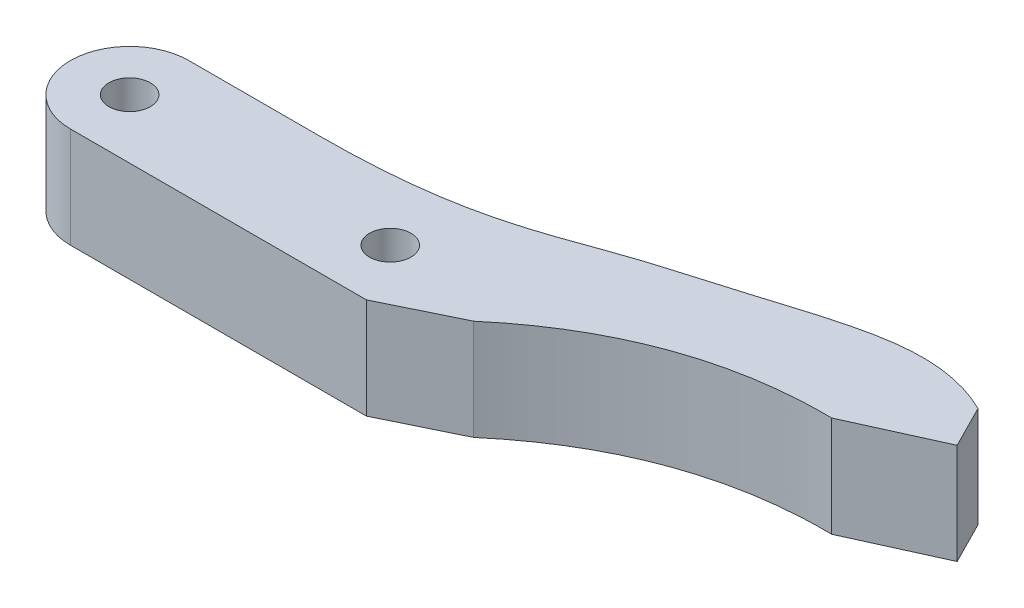
ISO-10303-21;
HEADER;
FILE_DESCRIPTION(('STEP AP214'),'2;1');
FILE_NAME('part.step','',(''),(''),'','','');
FILE_SCHEMA(('AUTOMOTIVE_DESIGN { 1 0 10303 214 1 1 1 1 }'));
ENDSEC;
DATA;
#1=APPLICATION_CONTEXT('core data for automotive mechanical design processes');
#2=APPLICATION_PROTOCOL_DEFINITION('international standard','automotive_design',2000,#1);
#3=PRODUCT_CONTEXT('',#1,'mechanical');
#4=PRODUCT('Part','Part','',(#3));
#5=PRODUCT_RELATED_PRODUCT_CATEGORY('part','',(#4));
#6=PRODUCT_DEFINITION_FORMATION('','',#4);
#7=PRODUCT_DEFINITION_CONTEXT('part definition',#1,'design');
#8=PRODUCT_DEFINITION('design','',#6,#7);
#9=PRODUCT_DEFINITION_SHAPE('','',#8);
#10=(LENGTH_UNIT() NAMED_UNIT(*) SI_UNIT(.MILLI.,.METRE.));
#11=(NAMED_UNIT(*) PLANE_ANGLE_UNIT() SI_UNIT($,.RADIAN.));
#12=(NAMED_UNIT(*) SI_UNIT($,.STERADIAN.) SOLID_ANGLE_UNIT());
#13=UNCERTAINTY_MEASURE_WITH_UNIT(LENGTH_MEASURE(1.E-05),#10,'distance_accuracy_value','');
#14=(GEOMETRIC_REPRESENTATION_CONTEXT(3) GLOBAL_UNCERTAINTY_ASSIGNED_CONTEXT((#13)) GLOBAL_UNIT_ASSIGNED_CONTEXT((#10,
#11,#12)) REPRESENTATION_CONTEXT('',''));
#15=CARTESIAN_POINT('',(0.,0.,0.));
#16=DIRECTION('',(0.,0.,1.));
#17=DIRECTION('',(1.,0.,0.));
#18=AXIS2_PLACEMENT_3D('',#15,#16,#17);
#19=CARTESIAN_POINT('',(0.,8.5,-5.));
#20=DIRECTION('',(0.,0.,1.));
#21=DIRECTION('',(1.,0.,0.));
#22=AXIS2_PLACEMENT_3D('',#19,#20,#21);
#23=PLANE('',#22);
#24=DIRECTION('',(0.,1.,0.));
#25=VECTOR('',#24,1.);
#26=CARTESIAN_POINT('',(11.,0.,-5.));
#27=LINE('',#26,#25);
#28=CARTESIAN_POINT('',(11.,0.,-5.));
#29=VERTEX_POINT('',#28);
#30=CARTESIAN_POINT('',(11.,8.5,-5.));
#31=VERTEX_POINT('',#30);
#32=EDGE_CURVE('E102',#29,#31,#27,.T.);
#33=ORIENTED_EDGE('',*,*,#32,.F.);
#34=DIRECTION('',(-1.,0.,0.));
#35=VECTOR('',#34,1.);
#36=CARTESIAN_POINT('',(0.,0.,-5.));
#37=LINE('',#36,#35);
#38=CARTESIAN_POINT('',(0.,0.,-5.));
#39=VERTEX_POINT('',#38);
#40=EDGE_CURVE('E91',#29,#39,#37,.T.);
#41=ORIENTED_EDGE('',*,*,#40,.T.);
#42=DIRECTION('',(0.,-1.,0.));
#43=VECTOR('',#42,1.);
#44=CARTESIAN_POINT('',(0.,8.5,-5.));
#45=LINE('',#44,#43);
#46=CARTESIAN_POINT('',(0.,8.5,-5.));
#47=VERTEX_POINT('',#46);
#48=EDGE_CURVE('E11',#47,#39,#45,.T.);
#49=ORIENTED_EDGE('',*,*,#48,.F.);
#50=DIRECTION('',(-1.,0.,0.));
#51=VECTOR('',#50,1.);
#52=CARTESIAN_POINT('',(0.,8.5,-5.));
#53=LINE('',#52,#51);
#54=EDGE_CURVE('E56',#31,#47,#53,.T.);
#55=ORIENTED_EDGE('',*,*,#54,.F.);
#56=EDGE_LOOP('',(#33,#41,#49,#55));
#57=FACE_BOUND('',#56,.T.);
#58=ADVANCED_FACE('F41',(#57),#23,.F.);
#59=CARTESIAN_POINT('',(0.,8.5,5.));
#60=DIRECTION('',(0.,0.,1.));
#61=DIRECTION('',(1.,0.,0.));
#62=AXIS2_PLACEMENT_3D('',#59,#60,#61);
#63=PLANE('',#62);
#64=DIRECTION('',(-1.,0.,0.));
#65=VECTOR('',#64,1.);
#66=CARTESIAN_POINT('',(0.,0.,5.));
#67=LINE('',#66,#65);
#68=CARTESIAN_POINT('',(24.99,0.,5.));
#69=VERTEX_POINT('',#68);
#70=CARTESIAN_POINT('',(0.,0.,5.));
#71=VERTEX_POINT('',#70);
#72=EDGE_CURVE('E80',#69,#71,#67,.T.);
#73=ORIENTED_EDGE('',*,*,#72,.F.);
#74=DIRECTION('',(0.,1.,0.));
#75=VECTOR('',#74,1.);
#76=CARTESIAN_POINT('',(24.99,0.,5.));
#77=LINE('',#76,#75);
#78=CARTESIAN_POINT('',(24.99,8.5,5.));
#79=VERTEX_POINT('',#78);
#80=EDGE_CURVE('E99',#69,#79,#77,.T.);
#81=ORIENTED_EDGE('',*,*,#80,.T.);
#82=DIRECTION('',(-1.,0.,0.));
#83=VECTOR('',#82,1.);
#84=CARTESIAN_POINT('',(0.,8.5,5.));
#85=LINE('',#84,#83);
#86=CARTESIAN_POINT('',(0.,8.5,5.));
#87=VERTEX_POINT('',#86);
#88=EDGE_CURVE('E82',#79,#87,#85,.T.);
#89=ORIENTED_EDGE('',*,*,#88,.T.);
#90=DIRECTION('',(0.,-1.,0.));
#91=VECTOR('',#90,1.);
#92=CARTESIAN_POINT('',(0.,8.5,5.));
#93=LINE('',#92,#91);
#94=EDGE_CURVE('E49',#87,#71,#93,.T.);
#95=ORIENTED_EDGE('',*,*,#94,.T.);
#96=EDGE_LOOP('',(#73,#81,#89,#95));
#97=FACE_BOUND('',#96,.T.);
#98=ADVANCED_FACE('F43',(#97),#63,.T.);
#99=CARTESIAN_POINT('',(0.,8.5,0.));
#100=DIRECTION('',(0.,-1.,0.));
#101=DIRECTION('',(0.,0.,-1.));
#102=AXIS2_PLACEMENT_3D('',#99,#100,#101);
#103=CYLINDRICAL_SURFACE('',#102,1.75);
#104=CARTESIAN_POINT('',(0.,8.5,0.));
#105=DIRECTION('',(0.,1.,0.));
#106=DIRECTION('',(0.,0.,1.));
#107=AXIS2_PLACEMENT_3D('',#104,#105,#106);
#108=CIRCLE('',#107,1.75);
#109=CARTESIAN_POINT('',(0.,8.5,1.75));
#110=VERTEX_POINT('',#109);
#111=EDGE_CURVE('E119',#110,#110,#108,.T.);
#112=ORIENTED_EDGE('',*,*,#111,.T.);
#113=EDGE_LOOP('',(#112));
#114=FACE_BOUND('',#113,.T.);
#115=CARTESIAN_POINT('',(0.,0.,0.));
#116=DIRECTION('',(0.,1.,0.));
#117=DIRECTION('',(0.,0.,1.));
#118=AXIS2_PLACEMENT_3D('',#115,#116,#117);
#119=CIRCLE('',#118,1.75);
#120=CARTESIAN_POINT('',(0.,0.,1.75));
#121=VERTEX_POINT('',#120);
#122=EDGE_CURVE('E90',#121,#121,#119,.T.);
#123=ORIENTED_EDGE('',*,*,#122,.F.);
#124=EDGE_LOOP('',(#123));
#125=FACE_BOUND('',#124,.T.);
#126=ADVANCED_FACE('F145',(#114,#125),#103,.F.);
#127=CARTESIAN_POINT('',(0.,8.5,0.));
#128=DIRECTION('',(0.,-1.,0.));
#129=DIRECTION('',(0.,0.,-1.));
#130=AXIS2_PLACEMENT_3D('',#127,#128,#129);
#131=CYLINDRICAL_SURFACE('',#130,5.);
#132=CARTESIAN_POINT('',(0.,0.,0.));
#133=DIRECTION('',(0.,1.,0.));
#134=DIRECTION('',(0.,0.,1.));
#135=AXIS2_PLACEMENT_3D('',#132,#133,#134);
#136=CIRCLE('',#135,5.);
#137=EDGE_CURVE('E86',#39,#71,#136,.T.);
#138=ORIENTED_EDGE('',*,*,#137,.T.);
#139=ORIENTED_EDGE('',*,*,#94,.F.);
#140=CARTESIAN_POINT('',(0.,8.5,0.));
#141=DIRECTION('',(0.,1.,0.));
#142=DIRECTION('',(0.,0.,1.));
#143=AXIS2_PLACEMENT_3D('',#140,#141,#142);
#144=CIRCLE('',#143,5.);
#145=EDGE_CURVE('E64',#47,#87,#144,.T.);
#146=ORIENTED_EDGE('',*,*,#145,.F.);
#147=ORIENTED_EDGE('',*,*,#48,.T.);
#148=EDGE_LOOP('',(#138,#139,#146,#147));
#149=FACE_BOUND('',#148,.T.);
#150=ADVANCED_FACE('F87',(#149),#131,.T.);
#151=CARTESIAN_POINT('',(22.,8.5,0.));
#152=DIRECTION('',(0.,-1.,0.));
#153=DIRECTION('',(0.,0.,-1.));
#154=AXIS2_PLACEMENT_3D('',#151,#152,#153);
#155=CYLINDRICAL_SURFACE('',#154,1.75);
#156=CARTESIAN_POINT('',(22.,8.5,0.));
#157=DIRECTION('',(0.,1.,0.));
#158=DIRECTION('',(0.,0.,1.));
#159=AXIS2_PLACEMENT_3D('',#156,#157,#158);
#160=CIRCLE('',#159,1.75);
#161=CARTESIAN_POINT('',(22.,8.5,1.75));
#162=VERTEX_POINT('',#161);
#163=EDGE_CURVE('E84',#162,#162,#160,.T.);
#164=ORIENTED_EDGE('',*,*,#163,.T.);
#165=EDGE_LOOP('',(#164));
#166=FACE_BOUND('',#165,.T.);
#167=CARTESIAN_POINT('',(22.,0.,0.));
#168=DIRECTION('',(0.,1.,0.));
#169=DIRECTION('',(0.,0.,1.));
#170=AXIS2_PLACEMENT_3D('',#167,#168,#169);
#171=CIRCLE('',#170,1.75);
#172=CARTESIAN_POINT('',(22.,0.,1.75));
#173=VERTEX_POINT('',#172);
#174=EDGE_CURVE('E109',#173,#173,#171,.T.);
#175=ORIENTED_EDGE('',*,*,#174,.F.);
#176=EDGE_LOOP('',(#175));
#177=FACE_BOUND('',#176,.T.);
#178=ADVANCED_FACE('F126',(#166,#177),#155,.F.);
#179=CARTESIAN_POINT('',(0.,8.5,0.));
#180=DIRECTION('',(0.,1.,0.));
#181=DIRECTION('',(0.,0.,1.));
#182=AXIS2_PLACEMENT_3D('',#179,#180,#181);
#183=PLANE('',#182);
#184=ORIENTED_EDGE('',*,*,#88,.F.);
#185=DIRECTION('',(0.898794046299166,0.,-0.438371146789079));
#186=VECTOR('',#185,1.);
#187=CARTESIAN_POINT('',(24.99,8.5,5.));
#188=LINE('',#187,#186);
#189=CARTESIAN_POINT('',(31.08,8.5,2.02970853563389));
#190=VERTEX_POINT('',#189);
#191=EDGE_CURVE('E259',#79,#190,#188,.T.);
#192=ORIENTED_EDGE('',*,*,#191,.T.);
#193=CARTESIAN_POINT('',(31.08,8.5,2.02970853563389));
#194=CARTESIAN_POINT('',(40.7387234524963,8.5,-6.18827081402431));
#195=CARTESIAN_POINT('',(53.27,8.5,-6.));
#196=B_SPLINE_CURVE_WITH_KNOTS('',2,(#193,#194,#195),.UNSPECIFIED.,.F.,.F.,(3,3),(0.,1.),.UNSPECIFIED.);
#197=CARTESIAN_POINT('',(53.27,8.5,-6.));
#198=VERTEX_POINT('',#197);
#199=EDGE_CURVE('E265',#190,#198,#196,.T.);
#200=ORIENTED_EDGE('',*,*,#199,.T.);
#201=DIRECTION('',(0.910876713981416,0.,-0.41267858186053));
#202=VECTOR('',#201,1.);
#203=CARTESIAN_POINT('',(60.5570137118513,8.5,-9.30142865488424));
#204=LINE('',#203,#202);
#205=CARTESIAN_POINT('',(60.5570137118513,8.5,-9.30142865488424));
#206=VERTEX_POINT('',#205);
#207=EDGE_CURVE('E270',#198,#206,#204,.T.);
#208=ORIENTED_EDGE('',*,*,#207,.T.);
#209=DIRECTION('',(-0.451753427962832,0.,-0.892142836278939));
#210=VECTOR('',#209,1.);
#211=CARTESIAN_POINT('',(58.75,8.5,-12.87));
#212=LINE('',#211,#210);
#213=CARTESIAN_POINT('',(58.75,8.5,-12.87));
#214=VERTEX_POINT('',#213);
#215=EDGE_CURVE('E276',#206,#214,#212,.T.);
#216=ORIENTED_EDGE('',*,*,#215,.T.);
#217=CARTESIAN_POINT('',(58.75,8.5,-12.87));
#218=CARTESIAN_POINT('',(52.5332622755505,8.5,-15.9183111540296));
#219=CARTESIAN_POINT('',(46.0601994387728,8.5,-12.9766839323231));
#220=CARTESIAN_POINT('',(28.9603677370955,8.5,-8.21999157962385));
#221=CARTESIAN_POINT('',(23.320985194396,8.5,-5.));
#222=CARTESIAN_POINT('',(11.,8.5,-5.));
#223=B_SPLINE_CURVE_WITH_KNOTS('',3,(#217,#218,#219,#220,#221,#222),.UNSPECIFIED.,.F.,.F.,(4,1,
1,4),(0.,0.537975125536328,0.637975125536328,1.),.UNSPECIFIED.);
#224=EDGE_CURVE('E279',#214,#31,#223,.T.);
#225=ORIENTED_EDGE('',*,*,#224,.T.);
#226=ORIENTED_EDGE('',*,*,#54,.T.);
#227=ORIENTED_EDGE('',*,*,#145,.T.);
#228=EDGE_LOOP('',(#184,#192,#200,#208,#216,#225,#226,#227));
#229=FACE_BOUND('',#228,.T.);
#230=ORIENTED_EDGE('',*,*,#111,.F.);
#231=EDGE_LOOP('',(#230));
#232=FACE_BOUND('',#231,.T.);
#233=ORIENTED_EDGE('',*,*,#163,.F.);
#234=EDGE_LOOP('',(#233));
#235=FACE_BOUND('',#234,.T.);
#236=ADVANCED_FACE('F129',(#229,#232,#235),#183,.T.);
#237=CARTESIAN_POINT('',(0.,0.,0.));
#238=DIRECTION('',(0.,1.,0.));
#239=DIRECTION('',(0.,0.,1.));
#240=AXIS2_PLACEMENT_3D('',#237,#238,#239);
#241=PLANE('',#240);
#242=ORIENTED_EDGE('',*,*,#72,.T.);
#243=ORIENTED_EDGE('',*,*,#137,.F.);
#244=ORIENTED_EDGE('',*,*,#40,.F.);
#245=CARTESIAN_POINT('',(58.75,0.,-12.87));
#246=CARTESIAN_POINT('',(52.5332622755505,0.,-15.9183111540296));
#247=CARTESIAN_POINT('',(46.0601994387728,0.,-12.9766839323231));
#248=CARTESIAN_POINT('',(28.9603677370955,0.,-8.21999157962385));
#249=CARTESIAN_POINT('',(23.320985194396,0.,-5.));
#250=CARTESIAN_POINT('',(11.,0.,-5.));
#251=B_SPLINE_CURVE_WITH_KNOTS('',3,(#245,#246,#247,#248,#249,#250),.UNSPECIFIED.,.F.,.F.,(4,1,
1,4),(0.,0.537975125536328,0.637975125536328,1.),.UNSPECIFIED.);
#252=CARTESIAN_POINT('',(58.75,0.,-12.87));
#253=VERTEX_POINT('',#252);
#254=EDGE_CURVE('E253',#253,#29,#251,.T.);
#255=ORIENTED_EDGE('',*,*,#254,.F.);
#256=DIRECTION('',(-0.451753427962832,0.,-0.892142836278939));
#257=VECTOR('',#256,1.);
#258=CARTESIAN_POINT('',(58.75,0.,-12.87));
#259=LINE('',#258,#257);
#260=CARTESIAN_POINT('',(60.5570137118513,0.,-9.30142865488424));
#261=VERTEX_POINT('',#260);
#262=EDGE_CURVE('E250',#261,#253,#259,.T.);
#263=ORIENTED_EDGE('',*,*,#262,.F.);
#264=DIRECTION('',(0.910876713981416,0.,-0.41267858186053));
#265=VECTOR('',#264,1.);
#266=CARTESIAN_POINT('',(60.5570137118513,0.,-9.30142865488424));
#267=LINE('',#266,#265);
#268=CARTESIAN_POINT('',(53.27,0.,-6.));
#269=VERTEX_POINT('',#268);
#270=EDGE_CURVE('E244',#269,#261,#267,.T.);
#271=ORIENTED_EDGE('',*,*,#270,.F.);
#272=CARTESIAN_POINT('',(31.08,0.,2.02970853563389));
#273=CARTESIAN_POINT('',(40.7387234524963,0.,-6.18827081402431));
#274=CARTESIAN_POINT('',(53.27,0.,-6.));
#275=B_SPLINE_CURVE_WITH_KNOTS('',2,(#272,#273,#274),.UNSPECIFIED.,.F.,.F.,(3,3),(0.,1.),.UNSPECIFIED.);
#276=CARTESIAN_POINT('',(31.08,0.,2.02970853563389));
#277=VERTEX_POINT('',#276);
#278=EDGE_CURVE('E237',#277,#269,#275,.T.);
#279=ORIENTED_EDGE('',*,*,#278,.F.);
#280=DIRECTION('',(0.898794046299166,0.,-0.438371146789079));
#281=VECTOR('',#280,1.);
#282=CARTESIAN_POINT('',(24.99,0.,5.));
#283=LINE('',#282,#281);
#284=EDGE_CURVE('E98',#69,#277,#283,.T.);
#285=ORIENTED_EDGE('',*,*,#284,.F.);
#286=EDGE_LOOP('',(#242,#243,#244,#255,#263,#271,#279,#285));
#287=FACE_BOUND('',#286,.T.);
#288=ORIENTED_EDGE('',*,*,#122,.T.);
#289=EDGE_LOOP('',(#288));
#290=FACE_BOUND('',#289,.T.);
#291=ORIENTED_EDGE('',*,*,#174,.T.);
#292=EDGE_LOOP('',(#291));
#293=FACE_BOUND('',#292,.T.);
#294=ADVANCED_FACE('F94',(#287,#290,#293),#241,.F.);
#295=CARTESIAN_POINT('',(24.99,0.,5.));
#296=DIRECTION('',(0.438371146789079,0.,0.898794046299166));
#297=DIRECTION('',(0.898794046299167,0.,-0.438371146789079));
#298=AXIS2_PLACEMENT_3D('',#295,#296,#297);
#299=PLANE('',#298);
#300=ORIENTED_EDGE('',*,*,#191,.F.);
#301=ORIENTED_EDGE('',*,*,#80,.F.);
#302=ORIENTED_EDGE('',*,*,#284,.T.);
#303=DIRECTION('',(0.,1.,0.));
#304=VECTOR('',#303,1.);
#305=CARTESIAN_POINT('',(31.08,0.,2.02970853563389));
#306=LINE('',#305,#304);
#307=EDGE_CURVE('E116',#277,#190,#306,.T.);
#308=ORIENTED_EDGE('',*,*,#307,.T.);
#309=EDGE_LOOP('',(#300,#301,#302,#308));
#310=FACE_BOUND('',#309,.T.);
#311=ADVANCED_FACE('F136',(#310),#299,.T.);
#312=DIRECTION('',(0.,1.,0.));
#313=VECTOR('',#312,1.);
#314=SURFACE_OF_LINEAR_EXTRUSION('',#251,#313);
#315=ORIENTED_EDGE('',*,*,#224,.F.);
#316=DIRECTION('',(0.,1.,0.));
#317=VECTOR('',#316,1.);
#318=CARTESIAN_POINT('',(58.75,0.,-12.87));
#319=LINE('',#318,#317);
#320=EDGE_CURVE('E288',#253,#214,#319,.T.);
#321=ORIENTED_EDGE('',*,*,#320,.F.);
#322=ORIENTED_EDGE('',*,*,#254,.T.);
#323=ORIENTED_EDGE('',*,*,#32,.T.);
#324=EDGE_LOOP('',(#315,#321,#322,#323));
#325=FACE_BOUND('',#324,.T.);
#326=ADVANCED_FACE('F202',(#325),#314,.T.);
#327=CARTESIAN_POINT('',(58.75,0.,-12.87));
#328=DIRECTION('',(0.892142836278939,0.,-0.451753427962833));
#329=DIRECTION('',(-0.451753427962833,0.,-0.892142836278939));
#330=AXIS2_PLACEMENT_3D('',#327,#328,#329);
#331=PLANE('',#330);
#332=ORIENTED_EDGE('',*,*,#215,.F.);
#333=DIRECTION('',(0.,1.,0.));
#334=VECTOR('',#333,1.);
#335=CARTESIAN_POINT('',(60.5570137118513,0.,-9.30142865488424));
#336=LINE('',#335,#334);
#337=EDGE_CURVE('E291',#261,#206,#336,.T.);
#338=ORIENTED_EDGE('',*,*,#337,.F.);
#339=ORIENTED_EDGE('',*,*,#262,.T.);
#340=ORIENTED_EDGE('',*,*,#320,.T.);
#341=EDGE_LOOP('',(#332,#338,#339,#340));
#342=FACE_BOUND('',#341,.T.);
#343=ADVANCED_FACE('F209',(#342),#331,.T.);
#344=CARTESIAN_POINT('',(60.5570137118513,0.,-9.30142865488424));
#345=DIRECTION('',(0.41267858186053,0.,0.910876713981416));
#346=DIRECTION('',(0.910876713981416,0.,-0.41267858186053));
#347=AXIS2_PLACEMENT_3D('',#344,#345,#346);
#348=PLANE('',#347);
#349=ORIENTED_EDGE('',*,*,#207,.F.);
#350=DIRECTION('',(0.,1.,0.));
#351=VECTOR('',#350,1.);
#352=CARTESIAN_POINT('',(53.27,0.,-6.));
#353=LINE('',#352,#351);
#354=EDGE_CURVE('E293',#269,#198,#353,.T.);
#355=ORIENTED_EDGE('',*,*,#354,.F.);
#356=ORIENTED_EDGE('',*,*,#270,.T.);
#357=ORIENTED_EDGE('',*,*,#337,.T.);
#358=EDGE_LOOP('',(#349,#355,#356,#357));
#359=FACE_BOUND('',#358,.T.);
#360=ADVANCED_FACE('F217',(#359),#348,.T.);
#361=DIRECTION('',(0.,1.,0.));
#362=VECTOR('',#361,1.);
#363=SURFACE_OF_LINEAR_EXTRUSION('',#275,#362);
#364=ORIENTED_EDGE('',*,*,#199,.F.);
#365=ORIENTED_EDGE('',*,*,#307,.F.);
#366=ORIENTED_EDGE('',*,*,#278,.T.);
#367=ORIENTED_EDGE('',*,*,#354,.T.);
#368=EDGE_LOOP('',(#364,#365,#366,#367));
#369=FACE_BOUND('',#368,.T.);
#370=ADVANCED_FACE('F225',(#369),#363,.T.);
#371=CLOSED_SHELL('',(#58,#98,#126,#150,#178,#236,#294,#311,#326,#343,#360,#370));
#372=MANIFOLD_SOLID_BREP('B2',#371);
#373=ADVANCED_BREP_SHAPE_REPRESENTATION('',(#18,#372),#14);
#374=SHAPE_DEFINITION_REPRESENTATION(#9,#373);
ENDSEC;
END-ISO-10303-21;
